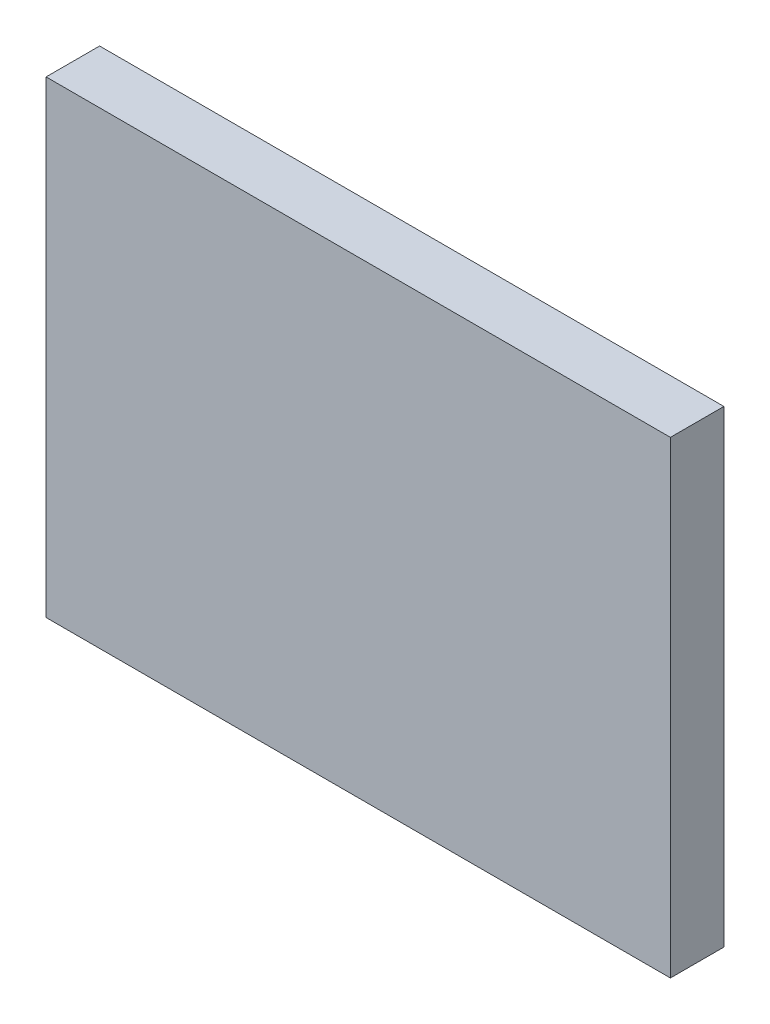
ISO-10303-21;
HEADER;
FILE_DESCRIPTION(('STEP AP214'),'2;1');
FILE_NAME('part.step','',(''),(''),'','','');
FILE_SCHEMA(('AUTOMOTIVE_DESIGN { 1 0 10303 214 1 1 1 1 }'));
ENDSEC;
DATA;
#1=APPLICATION_CONTEXT('core data for automotive mechanical design processes');
#2=APPLICATION_PROTOCOL_DEFINITION('international standard','automotive_design',2000,#1);
#3=PRODUCT_CONTEXT('',#1,'mechanical');
#4=PRODUCT('Part','Part','',(#3));
#5=PRODUCT_RELATED_PRODUCT_CATEGORY('part','',(#4));
#6=PRODUCT_DEFINITION_FORMATION('','',#4);
#7=PRODUCT_DEFINITION_CONTEXT('part definition',#1,'design');
#8=PRODUCT_DEFINITION('design','',#6,#7);
#9=PRODUCT_DEFINITION_SHAPE('','',#8);
#10=(LENGTH_UNIT() NAMED_UNIT(*) SI_UNIT(.MILLI.,.METRE.));
#11=(NAMED_UNIT(*) PLANE_ANGLE_UNIT() SI_UNIT($,.RADIAN.));
#12=(NAMED_UNIT(*) SI_UNIT($,.STERADIAN.) SOLID_ANGLE_UNIT());
#13=UNCERTAINTY_MEASURE_WITH_UNIT(LENGTH_MEASURE(1.E-05),#10,'distance_accuracy_value','');
#14=(GEOMETRIC_REPRESENTATION_CONTEXT(3) GLOBAL_UNCERTAINTY_ASSIGNED_CONTEXT((#13)) GLOBAL_UNIT_ASSIGNED_CONTEXT((#10,
#11,#12)) REPRESENTATION_CONTEXT('',''));
#15=CARTESIAN_POINT('',(0.,0.,0.));
#16=DIRECTION('',(0.,0.,1.));
#17=DIRECTION('',(1.,0.,0.));
#18=AXIS2_PLACEMENT_3D('',#15,#16,#17);
#19=CARTESIAN_POINT('',(3.15468,7.955108,0.76487));
#20=DIRECTION('',(0.,0.,-1.));
#21=DIRECTION('',(0.,1.,0.));
#22=AXIS2_PLACEMENT_3D('',#19,#20,#21);
#23=PLANE('',#22);
#24=DIRECTION('',(1.,0.,0.));
#25=VECTOR('',#24,1.);
#26=CARTESIAN_POINT('',(2.95468,8.105108,0.76487));
#27=LINE('',#26,#25);
#28=CARTESIAN_POINT('',(2.95468,8.105108,0.76487));
#29=VERTEX_POINT('',#28);
#30=CARTESIAN_POINT('',(3.35468,8.105108,0.76487));
#31=VERTEX_POINT('',#30);
#32=EDGE_CURVE('E55',#29,#31,#27,.T.);
#33=ORIENTED_EDGE('',*,*,#32,.T.);
#34=DIRECTION('',(0.,1.,0.));
#35=VECTOR('',#34,1.);
#36=CARTESIAN_POINT('',(3.35468,8.105108,0.76487));
#37=LINE('',#36,#35);
#38=CARTESIAN_POINT('',(3.35468,7.805108,0.76487));
#39=VERTEX_POINT('',#38);
#40=EDGE_CURVE('E57',#31,#39,#37,.F.);
#41=ORIENTED_EDGE('',*,*,#40,.T.);
#42=DIRECTION('',(1.,0.,0.));
#43=VECTOR('',#42,1.);
#44=CARTESIAN_POINT('',(3.35468,7.805108,0.76487));
#45=LINE('',#44,#43);
#46=CARTESIAN_POINT('',(2.95468,7.805108,0.76487));
#47=VERTEX_POINT('',#46);
#48=EDGE_CURVE('E20',#39,#47,#45,.F.);
#49=ORIENTED_EDGE('',*,*,#48,.T.);
#50=DIRECTION('',(0.,1.,0.));
#51=VECTOR('',#50,1.);
#52=CARTESIAN_POINT('',(2.95468,7.805108,0.76487));
#53=LINE('',#52,#51);
#54=EDGE_CURVE('E80',#47,#29,#53,.T.);
#55=ORIENTED_EDGE('',*,*,#54,.T.);
#56=EDGE_LOOP('',(#33,#41,#49,#55));
#57=FACE_BOUND('',#56,.T.);
#58=ADVANCED_FACE('F17',(#57),#23,.T.);
#59=CARTESIAN_POINT('',(3.35468,7.805108,0.76487));
#60=DIRECTION('',(0.,1.,0.));
#61=DIRECTION('',(0.,0.,1.));
#62=AXIS2_PLACEMENT_3D('',#59,#60,#61);
#63=PLANE('',#62);
#64=DIRECTION('',(0.,0.,-1.));
#65=VECTOR('',#64,1.);
#66=CARTESIAN_POINT('',(2.95468,7.805108,0.76487));
#67=LINE('',#66,#65);
#68=CARTESIAN_POINT('',(2.95468,7.805108,0.79916));
#69=VERTEX_POINT('',#68);
#70=EDGE_CURVE('E68',#69,#47,#67,.T.);
#71=ORIENTED_EDGE('',*,*,#70,.T.);
#72=ORIENTED_EDGE('',*,*,#48,.F.);
#73=DIRECTION('',(0.,0.,1.));
#74=VECTOR('',#73,1.);
#75=CARTESIAN_POINT('',(3.35468,7.805108,0.76487));
#76=LINE('',#75,#74);
#77=CARTESIAN_POINT('',(3.35468,7.805108,0.79916));
#78=VERTEX_POINT('',#77);
#79=EDGE_CURVE('E63',#39,#78,#76,.T.);
#80=ORIENTED_EDGE('',*,*,#79,.T.);
#81=DIRECTION('',(1.,0.,0.));
#82=VECTOR('',#81,1.);
#83=CARTESIAN_POINT('',(3.15468,7.805108,0.79916));
#84=LINE('',#83,#82);
#85=EDGE_CURVE('E83',#69,#78,#84,.T.);
#86=ORIENTED_EDGE('',*,*,#85,.F.);
#87=EDGE_LOOP('',(#71,#72,#80,#86));
#88=FACE_BOUND('',#87,.T.);
#89=ADVANCED_FACE('F65',(#88),#63,.F.);
#90=CARTESIAN_POINT('',(3.35468,8.105108,0.76487));
#91=DIRECTION('',(-1.,0.,0.));
#92=DIRECTION('',(0.,0.,1.));
#93=AXIS2_PLACEMENT_3D('',#90,#91,#92);
#94=PLANE('',#93);
#95=ORIENTED_EDGE('',*,*,#79,.F.);
#96=ORIENTED_EDGE('',*,*,#40,.F.);
#97=DIRECTION('',(0.,0.,-1.));
#98=VECTOR('',#97,1.);
#99=CARTESIAN_POINT('',(3.35468,8.105108,0.76487));
#100=LINE('',#99,#98);
#101=CARTESIAN_POINT('',(3.35468,8.105108,0.79916));
#102=VERTEX_POINT('',#101);
#103=EDGE_CURVE('E75',#31,#102,#100,.F.);
#104=ORIENTED_EDGE('',*,*,#103,.T.);
#105=DIRECTION('',(0.,-1.,0.));
#106=VECTOR('',#105,1.);
#107=CARTESIAN_POINT('',(3.35468,7.955108,0.79916));
#108=LINE('',#107,#106);
#109=EDGE_CURVE('E72',#78,#102,#108,.F.);
#110=ORIENTED_EDGE('',*,*,#109,.F.);
#111=EDGE_LOOP('',(#95,#96,#104,#110));
#112=FACE_BOUND('',#111,.T.);
#113=ADVANCED_FACE('F70',(#112),#94,.F.);
#114=CARTESIAN_POINT('',(2.95468,8.105108,0.76487));
#115=DIRECTION('',(0.,-1.,0.));
#116=DIRECTION('',(0.,0.,-1.));
#117=AXIS2_PLACEMENT_3D('',#114,#115,#116);
#118=PLANE('',#117);
#119=ORIENTED_EDGE('',*,*,#103,.F.);
#120=ORIENTED_EDGE('',*,*,#32,.F.);
#121=DIRECTION('',(0.,0.,-1.));
#122=VECTOR('',#121,1.);
#123=CARTESIAN_POINT('',(2.95468,8.105108,0.76487));
#124=LINE('',#123,#122);
#125=CARTESIAN_POINT('',(2.95468,8.105108,0.79916));
#126=VERTEX_POINT('',#125);
#127=EDGE_CURVE('E35',#29,#126,#124,.F.);
#128=ORIENTED_EDGE('',*,*,#127,.T.);
#129=DIRECTION('',(1.,0.,0.));
#130=VECTOR('',#129,1.);
#131=CARTESIAN_POINT('',(3.15468,8.105108,0.79916));
#132=LINE('',#131,#130);
#133=EDGE_CURVE('E26',#102,#126,#132,.F.);
#134=ORIENTED_EDGE('',*,*,#133,.F.);
#135=EDGE_LOOP('',(#119,#120,#128,#134));
#136=FACE_BOUND('',#135,.T.);
#137=ADVANCED_FACE('F89',(#136),#118,.F.);
#138=CARTESIAN_POINT('',(2.95468,7.805108,0.76487));
#139=DIRECTION('',(1.,0.,0.));
#140=DIRECTION('',(0.,0.,-1.));
#141=AXIS2_PLACEMENT_3D('',#138,#139,#140);
#142=PLANE('',#141);
#143=ORIENTED_EDGE('',*,*,#127,.F.);
#144=ORIENTED_EDGE('',*,*,#54,.F.);
#145=ORIENTED_EDGE('',*,*,#70,.F.);
#146=DIRECTION('',(0.,-1.,0.));
#147=VECTOR('',#146,1.);
#148=CARTESIAN_POINT('',(2.95468,7.955108,0.79916));
#149=LINE('',#148,#147);
#150=EDGE_CURVE('E11',#126,#69,#149,.T.);
#151=ORIENTED_EDGE('',*,*,#150,.F.);
#152=EDGE_LOOP('',(#143,#144,#145,#151));
#153=FACE_BOUND('',#152,.T.);
#154=ADVANCED_FACE('F91',(#153),#142,.F.);
#155=CARTESIAN_POINT('',(3.15468,7.955108,0.79916));
#156=DIRECTION('',(0.,0.,1.));
#157=DIRECTION('',(0.,-1.,0.));
#158=AXIS2_PLACEMENT_3D('',#155,#156,#157);
#159=PLANE('',#158);
#160=ORIENTED_EDGE('',*,*,#133,.T.);
#161=ORIENTED_EDGE('',*,*,#150,.T.);
#162=ORIENTED_EDGE('',*,*,#85,.T.);
#163=ORIENTED_EDGE('',*,*,#109,.T.);
#164=EDGE_LOOP('',(#160,#161,#162,#163));
#165=FACE_BOUND('',#164,.T.);
#166=ADVANCED_FACE('F88',(#165),#159,.T.);
#167=CLOSED_SHELL('',(#58,#89,#113,#137,#154,#166));
#168=MANIFOLD_SOLID_BREP('B1',#167);
#169=ADVANCED_BREP_SHAPE_REPRESENTATION('',(#18,#168),#14);
#170=SHAPE_DEFINITION_REPRESENTATION(#9,#169);
ENDSEC;
END-ISO-10303-21;
